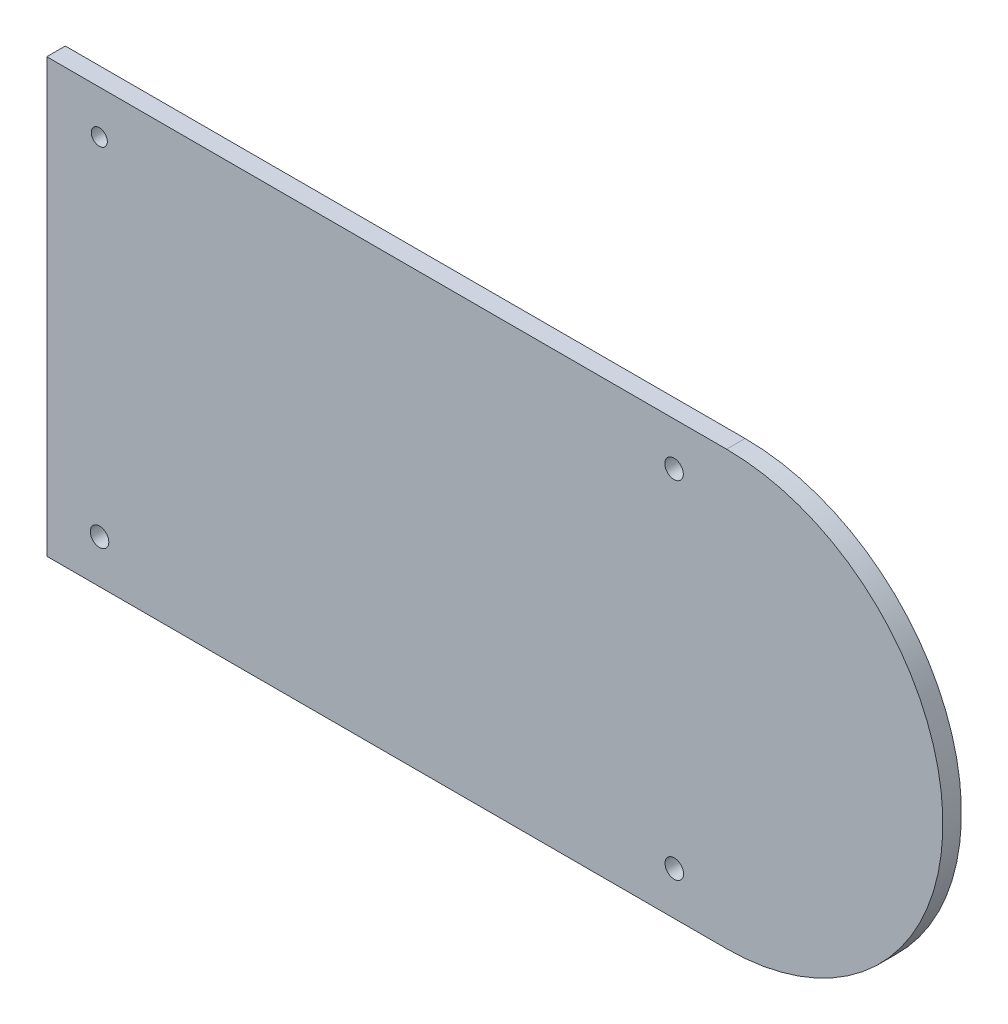
ISO-10303-21;
HEADER;
FILE_DESCRIPTION(('STEP AP214'),'2;1');
FILE_NAME('part.step','',(''),(''),'','','');
FILE_SCHEMA(('AUTOMOTIVE_DESIGN { 1 0 10303 214 1 1 1 1 }'));
ENDSEC;
DATA;
#1=APPLICATION_CONTEXT('core data for automotive mechanical design processes');
#2=APPLICATION_PROTOCOL_DEFINITION('international standard','automotive_design',2000,#1);
#3=PRODUCT_CONTEXT('',#1,'mechanical');
#4=PRODUCT('Part','Part','',(#3));
#5=PRODUCT_RELATED_PRODUCT_CATEGORY('part','',(#4));
#6=PRODUCT_DEFINITION_FORMATION('','',#4);
#7=PRODUCT_DEFINITION_CONTEXT('part definition',#1,'design');
#8=PRODUCT_DEFINITION('design','',#6,#7);
#9=PRODUCT_DEFINITION_SHAPE('','',#8);
#10=(LENGTH_UNIT() NAMED_UNIT(*) SI_UNIT(.MILLI.,.METRE.));
#11=(NAMED_UNIT(*) PLANE_ANGLE_UNIT() SI_UNIT($,.RADIAN.));
#12=(NAMED_UNIT(*) SI_UNIT($,.STERADIAN.) SOLID_ANGLE_UNIT());
#13=UNCERTAINTY_MEASURE_WITH_UNIT(LENGTH_MEASURE(1.E-05),#10,'distance_accuracy_value','');
#14=(GEOMETRIC_REPRESENTATION_CONTEXT(3) GLOBAL_UNCERTAINTY_ASSIGNED_CONTEXT((#13)) GLOBAL_UNIT_ASSIGNED_CONTEXT((#10,
#11,#12)) REPRESENTATION_CONTEXT('',''));
#15=CARTESIAN_POINT('',(0.,0.,0.));
#16=DIRECTION('',(0.,0.,1.));
#17=DIRECTION('',(1.,0.,0.));
#18=AXIS2_PLACEMENT_3D('',#15,#16,#17);
#19=CARTESIAN_POINT('',(42.5682801600808,-13.0210472379869,3.));
#20=DIRECTION('',(0.,0.,-1.));
#21=DIRECTION('',(-1.,0.,0.));
#22=AXIS2_PLACEMENT_3D('',#19,#20,#21);
#23=PLANE('',#22);
#24=CARTESIAN_POINT('',(34.1048804477804,-41.0210352774405,3.));
#25=DIRECTION('',(0.,0.,1.));
#26=DIRECTION('',(1.,0.,0.));
#27=AXIS2_PLACEMENT_3D('',#24,#25,#26);
#28=CIRCLE('',#27,1.5);
#29=CARTESIAN_POINT('',(35.6048804477804,-41.0210352774405,3.));
#30=VERTEX_POINT('',#29);
#31=EDGE_CURVE('E121',#30,#30,#28,.T.);
#32=ORIENTED_EDGE('',*,*,#31,.F.);
#33=EDGE_LOOP('',(#32));
#34=FACE_BOUND('',#33,.T.);
#35=CARTESIAN_POINT('',(-58.9317198399192,14.9789527620131,3.));
#36=DIRECTION('',(0.,0.,1.));
#37=DIRECTION('',(1.,0.,0.));
#38=AXIS2_PLACEMENT_3D('',#35,#36,#37);
#39=CIRCLE('',#38,1.29999999999999);
#40=CARTESIAN_POINT('',(-57.6317198399192,14.9789527620131,3.));
#41=VERTEX_POINT('',#40);
#42=EDGE_CURVE('E100',#41,#41,#39,.T.);
#43=ORIENTED_EDGE('',*,*,#42,.F.);
#44=EDGE_LOOP('',(#43));
#45=FACE_BOUND('',#44,.T.);
#46=DIRECTION('',(-1.,0.,0.));
#47=VECTOR('',#46,1.);
#48=CARTESIAN_POINT('',(42.5682801600808,21.9789527620131,3.));
#49=LINE('',#48,#47);
#50=CARTESIAN_POINT('',(42.5682801600808,21.9789527620131,3.));
#51=VERTEX_POINT('',#50);
#52=CARTESIAN_POINT('',(-67.4317198399193,21.9789527620131,3.));
#53=VERTEX_POINT('',#52);
#54=EDGE_CURVE('E85',#51,#53,#49,.T.);
#55=ORIENTED_EDGE('',*,*,#54,.T.);
#56=DIRECTION('',(0.,-1.,0.));
#57=VECTOR('',#56,1.);
#58=CARTESIAN_POINT('',(-67.4317198399193,21.9789527620131,3.));
#59=LINE('',#58,#57);
#60=CARTESIAN_POINT('',(-67.4317198399192,-48.0210472379869,3.));
#61=VERTEX_POINT('',#60);
#62=EDGE_CURVE('E80',#53,#61,#59,.T.);
#63=ORIENTED_EDGE('',*,*,#62,.T.);
#64=DIRECTION('',(1.,0.,0.));
#65=VECTOR('',#64,1.);
#66=CARTESIAN_POINT('',(-67.4317198399192,-48.0210472379869,3.));
#67=LINE('',#66,#65);
#68=CARTESIAN_POINT('',(42.5682801600808,-48.0210472379869,3.));
#69=VERTEX_POINT('',#68);
#70=EDGE_CURVE('E83',#61,#69,#67,.T.);
#71=ORIENTED_EDGE('',*,*,#70,.T.);
#72=CARTESIAN_POINT('',(42.5682801600808,-13.0210472379869,3.));
#73=DIRECTION('',(0.,0.,1.));
#74=DIRECTION('',(-1.,0.,0.));
#75=AXIS2_PLACEMENT_3D('',#72,#73,#74);
#76=CIRCLE('',#75,35.);
#77=EDGE_CURVE('E50',#69,#51,#76,.T.);
#78=ORIENTED_EDGE('',*,*,#77,.T.);
#79=EDGE_LOOP('',(#55,#63,#71,#78));
#80=FACE_BOUND('',#79,.T.);
#81=CARTESIAN_POINT('',(34.0682801600808,14.9789527620131,3.));
#82=DIRECTION('',(0.,0.,1.));
#83=DIRECTION('',(1.,0.,0.));
#84=AXIS2_PLACEMENT_3D('',#81,#82,#83);
#85=CIRCLE('',#84,1.5);
#86=CARTESIAN_POINT('',(35.5682801600807,14.9789527620131,3.));
#87=VERTEX_POINT('',#86);
#88=EDGE_CURVE('E115',#87,#87,#85,.T.);
#89=ORIENTED_EDGE('',*,*,#88,.F.);
#90=EDGE_LOOP('',(#89));
#91=FACE_BOUND('',#90,.T.);
#92=CARTESIAN_POINT('',(-58.8951195522196,-41.0210352774405,3.));
#93=DIRECTION('',(0.,0.,1.));
#94=DIRECTION('',(1.,0.,0.));
#95=AXIS2_PLACEMENT_3D('',#92,#93,#94);
#96=CIRCLE('',#95,1.5);
#97=CARTESIAN_POINT('',(-57.3951195522196,-41.0210352774405,3.));
#98=VERTEX_POINT('',#97);
#99=EDGE_CURVE('E127',#98,#98,#96,.T.);
#100=ORIENTED_EDGE('',*,*,#99,.F.);
#101=EDGE_LOOP('',(#100));
#102=FACE_BOUND('',#101,.T.);
#103=ADVANCED_FACE('F33',(#34,#45,#80,#91,#102),#23,.F.);
#104=CARTESIAN_POINT('',(42.5682801600808,-13.0210472379869,0.));
#105=DIRECTION('',(0.,0.,-1.));
#106=DIRECTION('',(-1.,0.,0.));
#107=AXIS2_PLACEMENT_3D('',#104,#105,#106);
#108=PLANE('',#107);
#109=CARTESIAN_POINT('',(34.1048804477804,-41.0210352774405,0.));
#110=DIRECTION('',(0.,0.,1.));
#111=DIRECTION('',(1.,0.,0.));
#112=AXIS2_PLACEMENT_3D('',#109,#110,#111);
#113=CIRCLE('',#112,1.5);
#114=CARTESIAN_POINT('',(35.6048804477804,-41.0210352774405,0.));
#115=VERTEX_POINT('',#114);
#116=EDGE_CURVE('E124',#115,#115,#113,.T.);
#117=ORIENTED_EDGE('',*,*,#116,.T.);
#118=EDGE_LOOP('',(#117));
#119=FACE_BOUND('',#118,.T.);
#120=CARTESIAN_POINT('',(-58.9317198399192,14.9789527620131,0.));
#121=DIRECTION('',(0.,0.,1.));
#122=DIRECTION('',(1.,0.,0.));
#123=AXIS2_PLACEMENT_3D('',#120,#121,#122);
#124=CIRCLE('',#123,1.29999999999999);
#125=CARTESIAN_POINT('',(-57.6317198399192,14.9789527620131,0.));
#126=VERTEX_POINT('',#125);
#127=EDGE_CURVE('E112',#126,#126,#124,.T.);
#128=ORIENTED_EDGE('',*,*,#127,.T.);
#129=EDGE_LOOP('',(#128));
#130=FACE_BOUND('',#129,.T.);
#131=DIRECTION('',(-1.,0.,0.));
#132=VECTOR('',#131,1.);
#133=CARTESIAN_POINT('',(42.5682801600808,21.9789527620131,0.));
#134=LINE('',#133,#132);
#135=CARTESIAN_POINT('',(42.5682801600808,21.9789527620131,0.));
#136=VERTEX_POINT('',#135);
#137=CARTESIAN_POINT('',(-67.4317198399193,21.9789527620131,0.));
#138=VERTEX_POINT('',#137);
#139=EDGE_CURVE('E97',#136,#138,#134,.T.);
#140=ORIENTED_EDGE('',*,*,#139,.F.);
#141=CARTESIAN_POINT('',(42.5682801600808,-13.0210472379869,0.));
#142=DIRECTION('',(0.,0.,1.));
#143=DIRECTION('',(-1.,0.,0.));
#144=AXIS2_PLACEMENT_3D('',#141,#142,#143);
#145=CIRCLE('',#144,35.);
#146=CARTESIAN_POINT('',(42.5682801600808,-48.0210472379869,0.));
#147=VERTEX_POINT('',#146);
#148=EDGE_CURVE('E73',#147,#136,#145,.T.);
#149=ORIENTED_EDGE('',*,*,#148,.F.);
#150=DIRECTION('',(1.,0.,0.));
#151=VECTOR('',#150,1.);
#152=CARTESIAN_POINT('',(-67.4317198399192,-48.0210472379869,0.));
#153=LINE('',#152,#151);
#154=CARTESIAN_POINT('',(-67.4317198399192,-48.0210472379869,0.));
#155=VERTEX_POINT('',#154);
#156=EDGE_CURVE('E67',#155,#147,#153,.T.);
#157=ORIENTED_EDGE('',*,*,#156,.F.);
#158=DIRECTION('',(0.,-1.,0.));
#159=VECTOR('',#158,1.);
#160=CARTESIAN_POINT('',(-67.4317198399193,21.9789527620131,0.));
#161=LINE('',#160,#159);
#162=EDGE_CURVE('E89',#138,#155,#161,.T.);
#163=ORIENTED_EDGE('',*,*,#162,.F.);
#164=EDGE_LOOP('',(#140,#149,#157,#163));
#165=FACE_BOUND('',#164,.T.);
#166=CARTESIAN_POINT('',(34.0682801600808,14.9789527620131,0.));
#167=DIRECTION('',(0.,0.,1.));
#168=DIRECTION('',(1.,0.,0.));
#169=AXIS2_PLACEMENT_3D('',#166,#167,#168);
#170=CIRCLE('',#169,1.5);
#171=CARTESIAN_POINT('',(35.5682801600807,14.9789527620131,0.));
#172=VERTEX_POINT('',#171);
#173=EDGE_CURVE('E118',#172,#172,#170,.T.);
#174=ORIENTED_EDGE('',*,*,#173,.T.);
#175=EDGE_LOOP('',(#174));
#176=FACE_BOUND('',#175,.T.);
#177=CARTESIAN_POINT('',(-58.8951195522196,-41.0210352774405,0.));
#178=DIRECTION('',(0.,0.,1.));
#179=DIRECTION('',(1.,0.,0.));
#180=AXIS2_PLACEMENT_3D('',#177,#178,#179);
#181=CIRCLE('',#180,1.5);
#182=CARTESIAN_POINT('',(-57.3951195522196,-41.0210352774405,0.));
#183=VERTEX_POINT('',#182);
#184=EDGE_CURVE('E130',#183,#183,#181,.T.);
#185=ORIENTED_EDGE('',*,*,#184,.T.);
#186=EDGE_LOOP('',(#185));
#187=FACE_BOUND('',#186,.T.);
#188=ADVANCED_FACE('F108',(#119,#130,#165,#176,#187),#108,.T.);
#189=CARTESIAN_POINT('',(42.5682801600808,21.9789527620131,3.));
#190=DIRECTION('',(0.,-1.,0.));
#191=DIRECTION('',(0.,0.,-1.));
#192=AXIS2_PLACEMENT_3D('',#189,#190,#191);
#193=PLANE('',#192);
#194=ORIENTED_EDGE('',*,*,#139,.T.);
#195=DIRECTION('',(0.,0.,-1.));
#196=VECTOR('',#195,1.);
#197=CARTESIAN_POINT('',(-67.4317198399193,21.9789527620131,3.));
#198=LINE('',#197,#196);
#199=EDGE_CURVE('E11',#53,#138,#198,.T.);
#200=ORIENTED_EDGE('',*,*,#199,.F.);
#201=ORIENTED_EDGE('',*,*,#54,.F.);
#202=DIRECTION('',(0.,0.,-1.));
#203=VECTOR('',#202,1.);
#204=CARTESIAN_POINT('',(42.5682801600808,21.9789527620131,3.));
#205=LINE('',#204,#203);
#206=EDGE_CURVE('E93',#51,#136,#205,.T.);
#207=ORIENTED_EDGE('',*,*,#206,.T.);
#208=EDGE_LOOP('',(#194,#200,#201,#207));
#209=FACE_BOUND('',#208,.T.);
#210=ADVANCED_FACE('F35',(#209),#193,.F.);
#211=CARTESIAN_POINT('',(-67.4317198399193,21.9789527620131,3.));
#212=DIRECTION('',(1.,0.,0.));
#213=DIRECTION('',(0.,1.,0.));
#214=AXIS2_PLACEMENT_3D('',#211,#212,#213);
#215=PLANE('',#214);
#216=ORIENTED_EDGE('',*,*,#162,.T.);
#217=DIRECTION('',(0.,0.,-1.));
#218=VECTOR('',#217,1.);
#219=CARTESIAN_POINT('',(-67.4317198399192,-48.0210472379869,3.));
#220=LINE('',#219,#218);
#221=EDGE_CURVE('E42',#61,#155,#220,.T.);
#222=ORIENTED_EDGE('',*,*,#221,.F.);
#223=ORIENTED_EDGE('',*,*,#62,.F.);
#224=ORIENTED_EDGE('',*,*,#199,.T.);
#225=EDGE_LOOP('',(#216,#222,#223,#224));
#226=FACE_BOUND('',#225,.T.);
#227=ADVANCED_FACE('F88',(#226),#215,.F.);
#228=CARTESIAN_POINT('',(-67.4317198399192,-48.0210472379869,3.));
#229=DIRECTION('',(0.,1.,0.));
#230=DIRECTION('',(0.,0.,1.));
#231=AXIS2_PLACEMENT_3D('',#228,#229,#230);
#232=PLANE('',#231);
#233=ORIENTED_EDGE('',*,*,#156,.T.);
#234=DIRECTION('',(0.,0.,-1.));
#235=VECTOR('',#234,1.);
#236=CARTESIAN_POINT('',(42.5682801600808,-48.0210472379869,3.));
#237=LINE('',#236,#235);
#238=EDGE_CURVE('E90',#69,#147,#237,.T.);
#239=ORIENTED_EDGE('',*,*,#238,.F.);
#240=ORIENTED_EDGE('',*,*,#70,.F.);
#241=ORIENTED_EDGE('',*,*,#221,.T.);
#242=EDGE_LOOP('',(#233,#239,#240,#241));
#243=FACE_BOUND('',#242,.T.);
#244=ADVANCED_FACE('F91',(#243),#232,.F.);
#245=CARTESIAN_POINT('',(42.5682801600808,-13.0210472379869,3.));
#246=DIRECTION('',(0.,0.,-1.));
#247=DIRECTION('',(-1.,0.,0.));
#248=AXIS2_PLACEMENT_3D('',#245,#246,#247);
#249=CYLINDRICAL_SURFACE('',#248,35.);
#250=ORIENTED_EDGE('',*,*,#148,.T.);
#251=ORIENTED_EDGE('',*,*,#206,.F.);
#252=ORIENTED_EDGE('',*,*,#77,.F.);
#253=ORIENTED_EDGE('',*,*,#238,.T.);
#254=EDGE_LOOP('',(#250,#251,#252,#253));
#255=FACE_BOUND('',#254,.T.);
#256=ADVANCED_FACE('F105',(#255),#249,.T.);
#257=CARTESIAN_POINT('',(-58.9317198399192,14.9789527620131,3.));
#258=DIRECTION('',(0.,0.,-1.));
#259=DIRECTION('',(-1.,0.,0.));
#260=AXIS2_PLACEMENT_3D('',#257,#258,#259);
#261=CYLINDRICAL_SURFACE('',#260,1.29999999999999);
#262=ORIENTED_EDGE('',*,*,#42,.T.);
#263=EDGE_LOOP('',(#262));
#264=FACE_BOUND('',#263,.T.);
#265=ORIENTED_EDGE('',*,*,#127,.F.);
#266=EDGE_LOOP('',(#265));
#267=FACE_BOUND('',#266,.T.);
#268=ADVANCED_FACE('F150',(#264,#267),#261,.F.);
#269=CARTESIAN_POINT('',(34.0682801600808,14.9789527620131,3.));
#270=DIRECTION('',(0.,0.,-1.));
#271=DIRECTION('',(-1.,0.,0.));
#272=AXIS2_PLACEMENT_3D('',#269,#270,#271);
#273=CYLINDRICAL_SURFACE('',#272,1.5);
#274=ORIENTED_EDGE('',*,*,#88,.T.);
#275=EDGE_LOOP('',(#274));
#276=FACE_BOUND('',#275,.T.);
#277=ORIENTED_EDGE('',*,*,#173,.F.);
#278=EDGE_LOOP('',(#277));
#279=FACE_BOUND('',#278,.T.);
#280=ADVANCED_FACE('F196',(#276,#279),#273,.F.);
#281=CARTESIAN_POINT('',(34.1048804477804,-41.0210352774405,3.));
#282=DIRECTION('',(0.,0.,-1.));
#283=DIRECTION('',(-1.,0.,0.));
#284=AXIS2_PLACEMENT_3D('',#281,#282,#283);
#285=CYLINDRICAL_SURFACE('',#284,1.5);
#286=ORIENTED_EDGE('',*,*,#31,.T.);
#287=EDGE_LOOP('',(#286));
#288=FACE_BOUND('',#287,.T.);
#289=ORIENTED_EDGE('',*,*,#116,.F.);
#290=EDGE_LOOP('',(#289));
#291=FACE_BOUND('',#290,.T.);
#292=ADVANCED_FACE('F204',(#288,#291),#285,.F.);
#293=CARTESIAN_POINT('',(-58.8951195522196,-41.0210352774405,3.));
#294=DIRECTION('',(0.,0.,-1.));
#295=DIRECTION('',(-1.,0.,0.));
#296=AXIS2_PLACEMENT_3D('',#293,#294,#295);
#297=CYLINDRICAL_SURFACE('',#296,1.5);
#298=ORIENTED_EDGE('',*,*,#99,.T.);
#299=EDGE_LOOP('',(#298));
#300=FACE_BOUND('',#299,.T.);
#301=ORIENTED_EDGE('',*,*,#184,.F.);
#302=EDGE_LOOP('',(#301));
#303=FACE_BOUND('',#302,.T.);
#304=ADVANCED_FACE('F136',(#300,#303),#297,.F.);
#305=CLOSED_SHELL('',(#103,#188,#210,#227,#244,#256,#268,#280,#292,#304));
#306=MANIFOLD_SOLID_BREP('B2',#305);
#307=ADVANCED_BREP_SHAPE_REPRESENTATION('',(#18,#306),#14);
#308=SHAPE_DEFINITION_REPRESENTATION(#9,#307);
ENDSEC;
END-ISO-10303-21;
